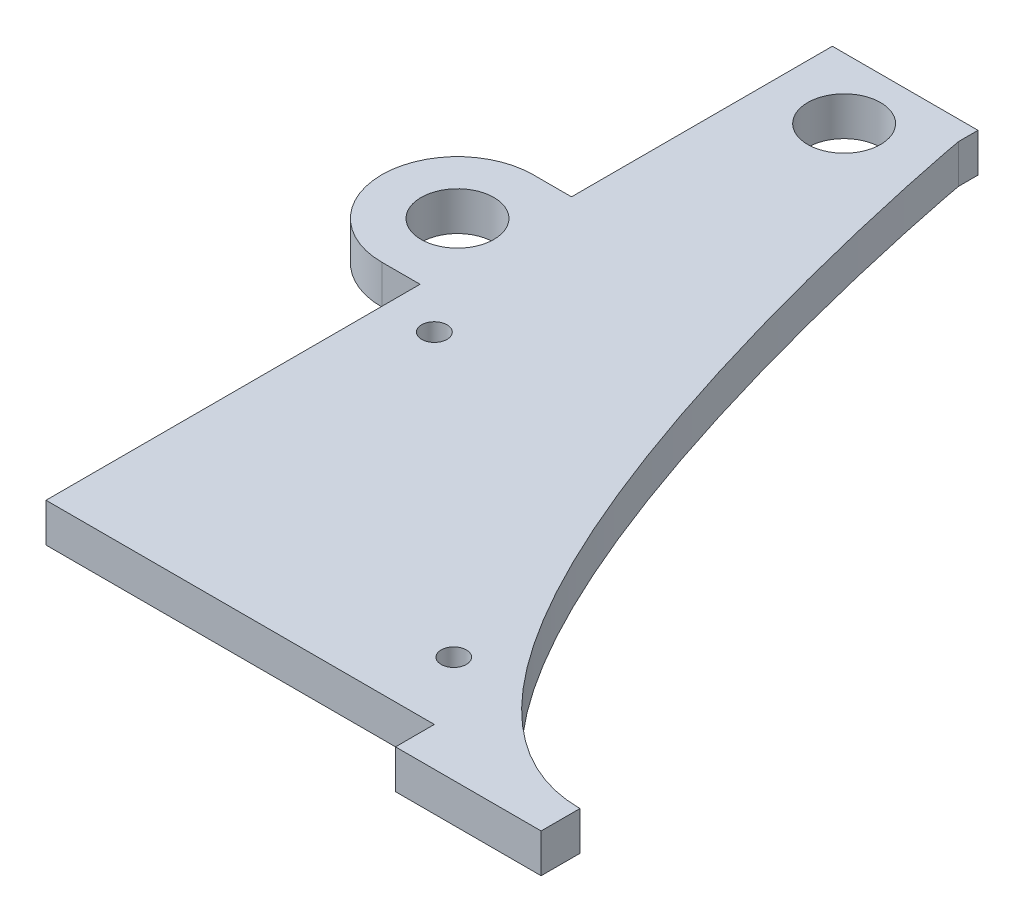
ISO-10303-21;
HEADER;
FILE_DESCRIPTION(('STEP AP214'),'2;1');
FILE_NAME('part.step','',(''),(''),'','','');
FILE_SCHEMA(('AUTOMOTIVE_DESIGN { 1 0 10303 214 1 1 1 1 }'));
ENDSEC;
DATA;
#1=APPLICATION_CONTEXT('core data for automotive mechanical design processes');
#2=APPLICATION_PROTOCOL_DEFINITION('international standard','automotive_design',2000,#1);
#3=PRODUCT_CONTEXT('',#1,'mechanical');
#4=PRODUCT('Part','Part','',(#3));
#5=PRODUCT_RELATED_PRODUCT_CATEGORY('part','',(#4));
#6=PRODUCT_DEFINITION_FORMATION('','',#4);
#7=PRODUCT_DEFINITION_CONTEXT('part definition',#1,'design');
#8=PRODUCT_DEFINITION('design','',#6,#7);
#9=PRODUCT_DEFINITION_SHAPE('','',#8);
#10=(LENGTH_UNIT() NAMED_UNIT(*) SI_UNIT(.MILLI.,.METRE.));
#11=(NAMED_UNIT(*) PLANE_ANGLE_UNIT() SI_UNIT($,.RADIAN.));
#12=(NAMED_UNIT(*) SI_UNIT($,.STERADIAN.) SOLID_ANGLE_UNIT());
#13=UNCERTAINTY_MEASURE_WITH_UNIT(LENGTH_MEASURE(1.E-05),#10,'distance_accuracy_value','');
#14=(GEOMETRIC_REPRESENTATION_CONTEXT(3) GLOBAL_UNCERTAINTY_ASSIGNED_CONTEXT((#13)) GLOBAL_UNIT_ASSIGNED_CONTEXT((#10,
#11,#12)) REPRESENTATION_CONTEXT('',''));
#15=CARTESIAN_POINT('',(0.,0.,0.));
#16=DIRECTION('',(0.,0.,1.));
#17=DIRECTION('',(1.,0.,0.));
#18=AXIS2_PLACEMENT_3D('',#15,#16,#17);
#19=CARTESIAN_POINT('',(-9.525,5.08,48.8950000000001));
#20=DIRECTION('',(1.,0.,0.));
#21=DIRECTION('',(0.,0.,-1.));
#22=AXIS2_PLACEMENT_3D('',#19,#20,#21);
#23=PLANE('',#22);
#24=DIRECTION('',(0.,0.,1.));
#25=VECTOR('',#24,1.);
#26=CARTESIAN_POINT('',(-9.525,5.08,48.8950000000001));
#27=LINE('',#26,#25);
#28=CARTESIAN_POINT('',(-9.52499999999999,5.08,-0.0375919999999405));
#29=VERTEX_POINT('',#28);
#30=CARTESIAN_POINT('',(-9.525,5.08,48.8950000000001));
#31=VERTEX_POINT('',#30);
#32=EDGE_CURVE('E58',#29,#31,#27,.T.);
#33=ORIENTED_EDGE('',*,*,#32,.F.);
#34=DIRECTION('',(0.,-1.,0.));
#35=VECTOR('',#34,1.);
#36=CARTESIAN_POINT('',(-9.52499999999998,5.08,-0.0375919999999405));
#37=LINE('',#36,#35);
#38=CARTESIAN_POINT('',(-9.52499999999999,0.,-0.0375919999999405));
#39=VERTEX_POINT('',#38);
#40=EDGE_CURVE('E179',#29,#39,#37,.T.);
#41=ORIENTED_EDGE('',*,*,#40,.T.);
#42=DIRECTION('',(0.,0.,1.));
#43=VECTOR('',#42,1.);
#44=CARTESIAN_POINT('',(-9.525,0.,48.8950000000001));
#45=LINE('',#44,#43);
#46=CARTESIAN_POINT('',(-9.525,0.,48.8950000000001));
#47=VERTEX_POINT('',#46);
#48=EDGE_CURVE('E494',#39,#47,#45,.T.);
#49=ORIENTED_EDGE('',*,*,#48,.T.);
#50=DIRECTION('',(0.,-1.,0.));
#51=VECTOR('',#50,1.);
#52=CARTESIAN_POINT('',(-9.525,5.08,48.8950000000001));
#53=LINE('',#52,#51);
#54=EDGE_CURVE('E521',#31,#47,#53,.T.);
#55=ORIENTED_EDGE('',*,*,#54,.F.);
#56=EDGE_LOOP('',(#33,#41,#49,#55));
#57=FACE_BOUND('',#56,.T.);
#58=ADVANCED_FACE('F42',(#57),#23,.F.);
#59=CARTESIAN_POINT('',(22.7352910938507,5.08,-1.18732961513015));
#60=DIRECTION('',(0.,-1.,0.));
#61=DIRECTION('',(0.,0.,-1.));
#62=AXIS2_PLACEMENT_3D('',#59,#60,#61);
#63=PLANE('',#62);
#64=DIRECTION('',(-1.,0.,0.));
#65=VECTOR('',#64,1.);
#66=CARTESIAN_POINT('',(-14.535912,5.08,-0.0375919999999405));
#67=LINE('',#66,#65);
#68=CARTESIAN_POINT('',(-14.535912,5.08,-0.0375919999999405));
#69=VERTEX_POINT('',#68);
#70=EDGE_CURVE('E144',#29,#69,#67,.T.);
#71=ORIENTED_EDGE('',*,*,#70,.F.);
#72=ORIENTED_EDGE('',*,*,#32,.T.);
#73=DIRECTION('',(1.,0.,0.));
#74=VECTOR('',#73,1.);
#75=CARTESIAN_POINT('',(60.325,5.08,48.8950000000001));
#76=LINE('',#75,#74);
#77=CARTESIAN_POINT('',(41.275,5.08,48.8950000000001));
#78=VERTEX_POINT('',#77);
#79=EDGE_CURVE('E251',#31,#78,#76,.T.);
#80=ORIENTED_EDGE('',*,*,#79,.T.);
#81=DIRECTION('',(0.,0.,1.));
#82=VECTOR('',#81,1.);
#83=CARTESIAN_POINT('',(41.275,5.08,48.8950000000001));
#84=LINE('',#83,#82);
#85=CARTESIAN_POINT('',(41.275,5.08,53.9750000000001));
#86=VERTEX_POINT('',#85);
#87=EDGE_CURVE('E205',#78,#86,#84,.T.);
#88=ORIENTED_EDGE('',*,*,#87,.T.);
#89=DIRECTION('',(1.,0.,0.));
#90=VECTOR('',#89,1.);
#91=CARTESIAN_POINT('',(60.325,5.08,53.9750000000001));
#92=LINE('',#91,#90);
#93=CARTESIAN_POINT('',(60.325,5.08,53.9750000000001));
#94=VERTEX_POINT('',#93);
#95=EDGE_CURVE('E200',#86,#94,#92,.T.);
#96=ORIENTED_EDGE('',*,*,#95,.T.);
#97=DIRECTION('',(0.,0.,-1.));
#98=VECTOR('',#97,1.);
#99=CARTESIAN_POINT('',(60.325,5.08,48.8950000000001));
#100=LINE('',#99,#98);
#101=CARTESIAN_POINT('',(60.325,5.08,48.8950000000001));
#102=VERTEX_POINT('',#101);
#103=EDGE_CURVE('E188',#94,#102,#100,.T.);
#104=ORIENTED_EDGE('',*,*,#103,.T.);
#105=CARTESIAN_POINT('',(60.325,5.08,48.895));
#106=CARTESIAN_POINT('',(27.8191095836019,5.08,48.895));
#107=CARTESIAN_POINT('',(9.525,5.08,-51.214545640347));
#108=CARTESIAN_POINT('',(9.525,5.08,-51.435));
#109=B_SPLINE_CURVE_WITH_KNOTS('',3,(#105,#106,#107,#108),.UNSPECIFIED.,.F.,.F.,(4,4),(0.,1.),.UNSPECIFIED.);
#110=CARTESIAN_POINT('',(9.525,5.08,-51.435));
#111=VERTEX_POINT('',#110);
#112=EDGE_CURVE('E255',#102,#111,#109,.T.);
#113=ORIENTED_EDGE('',*,*,#112,.T.);
#114=DIRECTION('',(0.,0.,-1.));
#115=VECTOR('',#114,1.);
#116=CARTESIAN_POINT('',(9.525,5.08,-51.435));
#117=LINE('',#116,#115);
#118=CARTESIAN_POINT('',(9.52499999999999,5.08,-53.9749999999999));
#119=VERTEX_POINT('',#118);
#120=EDGE_CURVE('E241',#111,#119,#117,.T.);
#121=ORIENTED_EDGE('',*,*,#120,.T.);
#122=DIRECTION('',(-1.,0.,0.));
#123=VECTOR('',#122,1.);
#124=CARTESIAN_POINT('',(-9.52499999999998,5.08,-53.9749999999999));
#125=LINE('',#124,#123);
#126=CARTESIAN_POINT('',(-9.52499999999998,5.08,-53.9749999999999));
#127=VERTEX_POINT('',#126);
#128=EDGE_CURVE('E245',#119,#127,#125,.T.);
#129=ORIENTED_EDGE('',*,*,#128,.T.);
#130=CARTESIAN_POINT('',(-9.52499999999999,5.08,-19.8495919999999));
#131=VERTEX_POINT('',#130);
#132=EDGE_CURVE('E153',#127,#131,#27,.T.);
#133=ORIENTED_EDGE('',*,*,#132,.T.);
#134=DIRECTION('',(1.,0.,0.));
#135=VECTOR('',#134,1.);
#136=CARTESIAN_POINT('',(-14.535912,5.08,-19.8495919999999));
#137=LINE('',#136,#135);
#138=CARTESIAN_POINT('',(-14.535912,5.08,-19.8495919999999));
#139=VERTEX_POINT('',#138);
#140=EDGE_CURVE('E136',#139,#131,#137,.T.);
#141=ORIENTED_EDGE('',*,*,#140,.F.);
#142=CARTESIAN_POINT('',(-14.535912,5.08,-9.94359199999994));
#143=DIRECTION('',(0.,-1.,0.));
#144=DIRECTION('',(0.,0.,-1.));
#145=AXIS2_PLACEMENT_3D('',#142,#143,#144);
#146=CIRCLE('',#145,9.906);
#147=EDGE_CURVE('E151',#69,#139,#146,.T.);
#148=ORIENTED_EDGE('',*,*,#147,.F.);
#149=EDGE_LOOP('',(#71,#72,#80,#88,#96,#104,#113,#121,#129,#133,#141,#148));
#150=FACE_BOUND('',#149,.T.);
#151=CARTESIAN_POINT('',(34.925,5.08,40.0050000000001));
#152=DIRECTION('',(0.,-1.,0.));
#153=DIRECTION('',(0.,0.,-1.));
#154=AXIS2_PLACEMENT_3D('',#151,#152,#153);
#155=CIRCLE('',#154,1.651);
#156=CARTESIAN_POINT('',(34.925,5.08,38.3540000000001));
#157=VERTEX_POINT('',#156);
#158=EDGE_CURVE('E184',#157,#157,#155,.T.);
#159=ORIENTED_EDGE('',*,*,#158,.T.);
#160=EDGE_LOOP('',(#159));
#161=FACE_BOUND('',#160,.T.);
#162=CARTESIAN_POINT('',(-3.17499999999998,5.08,4.44500000000005));
#163=DIRECTION('',(0.,-1.,0.));
#164=DIRECTION('',(0.,0.,-1.));
#165=AXIS2_PLACEMENT_3D('',#162,#163,#164);
#166=CIRCLE('',#165,1.66072838208594);
#167=CARTESIAN_POINT('',(-3.17499999999998,5.08,2.78427161791411));
#168=VERTEX_POINT('',#167);
#169=EDGE_CURVE('E178',#168,#168,#166,.T.);
#170=ORIENTED_EDGE('',*,*,#169,.T.);
#171=EDGE_LOOP('',(#170));
#172=FACE_BOUND('',#171,.T.);
#173=CARTESIAN_POINT('',(0.,5.08,-45.9866999999999));
#174=DIRECTION('',(0.,1.,0.));
#175=DIRECTION('',(0.,0.,1.));
#176=AXIS2_PLACEMENT_3D('',#173,#174,#175);
#177=CIRCLE('',#176,4.7625);
#178=CARTESIAN_POINT('',(0.,5.08,-41.2241999999999));
#179=VERTEX_POINT('',#178);
#180=EDGE_CURVE('E233',#179,#179,#177,.T.);
#181=ORIENTED_EDGE('',*,*,#180,.F.);
#182=EDGE_LOOP('',(#181));
#183=FACE_BOUND('',#182,.T.);
#184=CARTESIAN_POINT('',(-14.535912,5.08,-9.94359199999994));
#185=DIRECTION('',(0.,-1.,0.));
#186=DIRECTION('',(0.,0.,-1.));
#187=AXIS2_PLACEMENT_3D('',#184,#185,#186);
#188=CIRCLE('',#187,4.7625);
#189=CARTESIAN_POINT('',(-14.535912,5.08,-14.7060919999999));
#190=VERTEX_POINT('',#189);
#191=EDGE_CURVE('E173',#190,#190,#188,.T.);
#192=ORIENTED_EDGE('',*,*,#191,.T.);
#193=EDGE_LOOP('',(#192));
#194=FACE_BOUND('',#193,.T.);
#195=ADVANCED_FACE('F149',(#150,#161,#172,#183,#194),#63,.F.);
#196=CARTESIAN_POINT('',(22.7352910938507,0.,-1.18732961513015));
#197=DIRECTION('',(0.,-1.,0.));
#198=DIRECTION('',(0.,0.,-1.));
#199=AXIS2_PLACEMENT_3D('',#196,#197,#198);
#200=PLANE('',#199);
#201=ORIENTED_EDGE('',*,*,#48,.F.);
#202=DIRECTION('',(-1.,0.,0.));
#203=VECTOR('',#202,1.);
#204=CARTESIAN_POINT('',(-14.535912,0.,-0.0375919999999405));
#205=LINE('',#204,#203);
#206=CARTESIAN_POINT('',(-14.535912,0.,-0.0375919999999405));
#207=VERTEX_POINT('',#206);
#208=EDGE_CURVE('E159',#39,#207,#205,.T.);
#209=ORIENTED_EDGE('',*,*,#208,.T.);
#210=CARTESIAN_POINT('',(-14.535912,0.,-9.94359199999994));
#211=DIRECTION('',(0.,-1.,0.));
#212=DIRECTION('',(0.,0.,-1.));
#213=AXIS2_PLACEMENT_3D('',#210,#211,#212);
#214=CIRCLE('',#213,9.906);
#215=CARTESIAN_POINT('',(-14.535912,0.,-19.8495919999999));
#216=VERTEX_POINT('',#215);
#217=EDGE_CURVE('E170',#207,#216,#214,.T.);
#218=ORIENTED_EDGE('',*,*,#217,.T.);
#219=DIRECTION('',(1.,0.,0.));
#220=VECTOR('',#219,1.);
#221=CARTESIAN_POINT('',(-14.535912,0.,-19.8495919999999));
#222=LINE('',#221,#220);
#223=CARTESIAN_POINT('',(-9.52499999999999,0.,-19.8495919999999));
#224=VERTEX_POINT('',#223);
#225=EDGE_CURVE('E138',#216,#224,#222,.T.);
#226=ORIENTED_EDGE('',*,*,#225,.T.);
#227=CARTESIAN_POINT('',(-9.52499999999998,0.,-53.9749999999999));
#228=VERTEX_POINT('',#227);
#229=EDGE_CURVE('E499',#228,#224,#45,.T.);
#230=ORIENTED_EDGE('',*,*,#229,.F.);
#231=DIRECTION('',(-1.,0.,0.));
#232=VECTOR('',#231,1.);
#233=CARTESIAN_POINT('',(-9.52499999999998,0.,-53.9749999999999));
#234=LINE('',#233,#232);
#235=CARTESIAN_POINT('',(9.52499999999999,0.,-53.9749999999999));
#236=VERTEX_POINT('',#235);
#237=EDGE_CURVE('E500',#236,#228,#234,.T.);
#238=ORIENTED_EDGE('',*,*,#237,.F.);
#239=DIRECTION('',(0.,0.,-1.));
#240=VECTOR('',#239,1.);
#241=CARTESIAN_POINT('',(9.525,0.,-51.435));
#242=LINE('',#241,#240);
#243=CARTESIAN_POINT('',(9.525,0.,-51.435));
#244=VERTEX_POINT('',#243);
#245=EDGE_CURVE('E237',#244,#236,#242,.T.);
#246=ORIENTED_EDGE('',*,*,#245,.F.);
#247=CARTESIAN_POINT('',(60.325,0.,48.895));
#248=CARTESIAN_POINT('',(27.8191095836019,0.,48.895));
#249=CARTESIAN_POINT('',(9.525,0.,-51.214545640347));
#250=CARTESIAN_POINT('',(9.525,0.,-51.435));
#251=B_SPLINE_CURVE_WITH_KNOTS('',3,(#247,#248,#249,#250),.UNSPECIFIED.,.F.,.F.,(4,4),(0.,1.),.UNSPECIFIED.);
#252=CARTESIAN_POINT('',(60.325,0.,48.8950000000001));
#253=VERTEX_POINT('',#252);
#254=EDGE_CURVE('E246',#253,#244,#251,.T.);
#255=ORIENTED_EDGE('',*,*,#254,.F.);
#256=DIRECTION('',(0.,0.,-1.));
#257=VECTOR('',#256,1.);
#258=CARTESIAN_POINT('',(60.325,0.,48.8950000000001));
#259=LINE('',#258,#257);
#260=CARTESIAN_POINT('',(60.325,0.,53.9750000000001));
#261=VERTEX_POINT('',#260);
#262=EDGE_CURVE('E212',#261,#253,#259,.T.);
#263=ORIENTED_EDGE('',*,*,#262,.F.);
#264=DIRECTION('',(1.,0.,0.));
#265=VECTOR('',#264,1.);
#266=CARTESIAN_POINT('',(60.325,0.,53.9750000000001));
#267=LINE('',#266,#265);
#268=CARTESIAN_POINT('',(41.275,0.,53.9750000000001));
#269=VERTEX_POINT('',#268);
#270=EDGE_CURVE('E217',#269,#261,#267,.T.);
#271=ORIENTED_EDGE('',*,*,#270,.F.);
#272=DIRECTION('',(0.,0.,1.));
#273=VECTOR('',#272,1.);
#274=CARTESIAN_POINT('',(41.275,0.,48.8950000000001));
#275=LINE('',#274,#273);
#276=CARTESIAN_POINT('',(41.275,0.,48.8950000000001));
#277=VERTEX_POINT('',#276);
#278=EDGE_CURVE('E222',#277,#269,#275,.T.);
#279=ORIENTED_EDGE('',*,*,#278,.F.);
#280=DIRECTION('',(1.,0.,0.));
#281=VECTOR('',#280,1.);
#282=CARTESIAN_POINT('',(60.325,0.,48.8950000000001));
#283=LINE('',#282,#281);
#284=EDGE_CURVE('E496',#47,#277,#283,.T.);
#285=ORIENTED_EDGE('',*,*,#284,.F.);
#286=EDGE_LOOP('',(#201,#209,#218,#226,#230,#238,#246,#255,#263,#271,#279,#285));
#287=FACE_BOUND('',#286,.T.);
#288=CARTESIAN_POINT('',(34.925,0.,40.0050000000001));
#289=DIRECTION('',(0.,-1.,0.));
#290=DIRECTION('',(0.,0.,-1.));
#291=AXIS2_PLACEMENT_3D('',#288,#289,#290);
#292=CIRCLE('',#291,1.651);
#293=CARTESIAN_POINT('',(34.925,0.,38.3540000000001));
#294=VERTEX_POINT('',#293);
#295=EDGE_CURVE('E189',#294,#294,#292,.T.);
#296=ORIENTED_EDGE('',*,*,#295,.F.);
#297=EDGE_LOOP('',(#296));
#298=FACE_BOUND('',#297,.T.);
#299=CARTESIAN_POINT('',(-3.17499999999998,0.,4.44500000000005));
#300=DIRECTION('',(0.,-1.,0.));
#301=DIRECTION('',(0.,0.,-1.));
#302=AXIS2_PLACEMENT_3D('',#299,#300,#301);
#303=CIRCLE('',#302,1.66072838208594);
#304=CARTESIAN_POINT('',(-3.17499999999998,0.,2.78427161791411));
#305=VERTEX_POINT('',#304);
#306=EDGE_CURVE('E193',#305,#305,#303,.T.);
#307=ORIENTED_EDGE('',*,*,#306,.F.);
#308=EDGE_LOOP('',(#307));
#309=FACE_BOUND('',#308,.T.);
#310=CARTESIAN_POINT('',(0.,0.,-45.9866999999999));
#311=DIRECTION('',(0.,1.,0.));
#312=DIRECTION('',(0.,0.,1.));
#313=AXIS2_PLACEMENT_3D('',#310,#311,#312);
#314=CIRCLE('',#313,4.7625);
#315=CARTESIAN_POINT('',(0.,0.,-41.2241999999999));
#316=VERTEX_POINT('',#315);
#317=EDGE_CURVE('E215',#316,#316,#314,.T.);
#318=ORIENTED_EDGE('',*,*,#317,.T.);
#319=EDGE_LOOP('',(#318));
#320=FACE_BOUND('',#319,.T.);
#321=CARTESIAN_POINT('',(-14.535912,0.,-9.94359199999994));
#322=DIRECTION('',(0.,-1.,0.));
#323=DIRECTION('',(0.,0.,-1.));
#324=AXIS2_PLACEMENT_3D('',#321,#322,#323);
#325=CIRCLE('',#324,4.7625);
#326=CARTESIAN_POINT('',(-14.535912,0.,-14.7060919999999));
#327=VERTEX_POINT('',#326);
#328=EDGE_CURVE('E165',#327,#327,#325,.T.);
#329=ORIENTED_EDGE('',*,*,#328,.F.);
#330=EDGE_LOOP('',(#329));
#331=FACE_BOUND('',#330,.T.);
#332=ADVANCED_FACE('F274',(#287,#298,#309,#320,#331),#200,.T.);
#333=CARTESIAN_POINT('',(9.525,5.08,-51.435));
#334=DIRECTION('',(-1.,0.,0.));
#335=DIRECTION('',(0.,0.,1.));
#336=AXIS2_PLACEMENT_3D('',#333,#334,#335);
#337=PLANE('',#336);
#338=ORIENTED_EDGE('',*,*,#245,.T.);
#339=DIRECTION('',(0.,-1.,0.));
#340=VECTOR('',#339,1.);
#341=CARTESIAN_POINT('',(9.52499999999999,5.08,-53.9749999999999));
#342=LINE('',#341,#340);
#343=EDGE_CURVE('E11',#119,#236,#342,.T.);
#344=ORIENTED_EDGE('',*,*,#343,.F.);
#345=ORIENTED_EDGE('',*,*,#120,.F.);
#346=DIRECTION('',(0.,-1.,0.));
#347=VECTOR('',#346,1.);
#348=CARTESIAN_POINT('',(9.525,5.08,-51.435));
#349=LINE('',#348,#347);
#350=EDGE_CURVE('E261',#111,#244,#349,.T.);
#351=ORIENTED_EDGE('',*,*,#350,.T.);
#352=EDGE_LOOP('',(#338,#344,#345,#351));
#353=FACE_BOUND('',#352,.T.);
#354=ADVANCED_FACE('F44',(#353),#337,.F.);
#355=CARTESIAN_POINT('',(-9.52499999999998,5.08,-53.9749999999999));
#356=DIRECTION('',(0.,0.,1.));
#357=DIRECTION('',(1.,0.,0.));
#358=AXIS2_PLACEMENT_3D('',#355,#356,#357);
#359=PLANE('',#358);
#360=ORIENTED_EDGE('',*,*,#237,.T.);
#361=DIRECTION('',(0.,-1.,0.));
#362=VECTOR('',#361,1.);
#363=CARTESIAN_POINT('',(-9.52499999999998,5.08,-53.9749999999999));
#364=LINE('',#363,#362);
#365=EDGE_CURVE('E51',#127,#228,#364,.T.);
#366=ORIENTED_EDGE('',*,*,#365,.F.);
#367=ORIENTED_EDGE('',*,*,#128,.F.);
#368=ORIENTED_EDGE('',*,*,#343,.T.);
#369=EDGE_LOOP('',(#360,#366,#367,#368));
#370=FACE_BOUND('',#369,.T.);
#371=ADVANCED_FACE('F281',(#370),#359,.F.);
#372=ORIENTED_EDGE('',*,*,#229,.T.);
#373=DIRECTION('',(0.,-1.,0.));
#374=VECTOR('',#373,1.);
#375=CARTESIAN_POINT('',(-9.52499999999998,5.08,-19.8495919999999));
#376=LINE('',#375,#374);
#377=EDGE_CURVE('E66',#131,#224,#376,.T.);
#378=ORIENTED_EDGE('',*,*,#377,.F.);
#379=ORIENTED_EDGE('',*,*,#132,.F.);
#380=ORIENTED_EDGE('',*,*,#365,.T.);
#381=EDGE_LOOP('',(#372,#378,#379,#380));
#382=FACE_BOUND('',#381,.T.);
#383=ADVANCED_FACE('F278',(#382),#23,.F.);
#384=CARTESIAN_POINT('',(60.325,5.08,48.8950000000001));
#385=DIRECTION('',(0.,0.,-1.));
#386=DIRECTION('',(-1.,0.,0.));
#387=AXIS2_PLACEMENT_3D('',#384,#385,#386);
#388=PLANE('',#387);
#389=ORIENTED_EDGE('',*,*,#284,.T.);
#390=DIRECTION('',(0.,1.,0.));
#391=VECTOR('',#390,1.);
#392=CARTESIAN_POINT('',(41.275,-19.7157018642502,48.8950000000001));
#393=LINE('',#392,#391);
#394=EDGE_CURVE('E204',#277,#78,#393,.T.);
#395=ORIENTED_EDGE('',*,*,#394,.T.);
#396=ORIENTED_EDGE('',*,*,#79,.F.);
#397=ORIENTED_EDGE('',*,*,#54,.T.);
#398=EDGE_LOOP('',(#389,#395,#396,#397));
#399=FACE_BOUND('',#398,.T.);
#400=ADVANCED_FACE('F272',(#399),#388,.F.);
#401=DIRECTION('',(0.,-1.,0.));
#402=VECTOR('',#401,1.);
#403=SURFACE_OF_LINEAR_EXTRUSION('',#109,#402);
#404=ORIENTED_EDGE('',*,*,#254,.T.);
#405=ORIENTED_EDGE('',*,*,#350,.F.);
#406=ORIENTED_EDGE('',*,*,#112,.F.);
#407=DIRECTION('',(0.,-1.,0.));
#408=VECTOR('',#407,1.);
#409=CARTESIAN_POINT('',(60.325,5.08,48.8950000000001));
#410=LINE('',#409,#408);
#411=EDGE_CURVE('E517',#102,#253,#410,.T.);
#412=ORIENTED_EDGE('',*,*,#411,.T.);
#413=EDGE_LOOP('',(#404,#405,#406,#412));
#414=FACE_BOUND('',#413,.T.);
#415=ADVANCED_FACE('F267',(#414),#403,.F.);
#416=CARTESIAN_POINT('',(0.,5.08,-45.9866999999999));
#417=DIRECTION('',(0.,-1.,0.));
#418=DIRECTION('',(0.,0.,-1.));
#419=AXIS2_PLACEMENT_3D('',#416,#417,#418);
#420=CYLINDRICAL_SURFACE('',#419,4.7625);
#421=ORIENTED_EDGE('',*,*,#180,.T.);
#422=EDGE_LOOP('',(#421));
#423=FACE_BOUND('',#422,.T.);
#424=ORIENTED_EDGE('',*,*,#317,.F.);
#425=EDGE_LOOP('',(#424));
#426=FACE_BOUND('',#425,.T.);
#427=ADVANCED_FACE('F271',(#423,#426),#420,.F.);
#428=CARTESIAN_POINT('',(41.275,-19.7157018642502,48.8950000000001));
#429=DIRECTION('',(-1.,0.,0.));
#430=DIRECTION('',(0.,0.,1.));
#431=AXIS2_PLACEMENT_3D('',#428,#429,#430);
#432=PLANE('',#431);
#433=ORIENTED_EDGE('',*,*,#394,.F.);
#434=ORIENTED_EDGE('',*,*,#278,.T.);
#435=DIRECTION('',(0.,1.,0.));
#436=VECTOR('',#435,1.);
#437=CARTESIAN_POINT('',(41.275,-19.7157018642502,53.9750000000001));
#438=LINE('',#437,#436);
#439=EDGE_CURVE('E221',#269,#86,#438,.T.);
#440=ORIENTED_EDGE('',*,*,#439,.T.);
#441=ORIENTED_EDGE('',*,*,#87,.F.);
#442=EDGE_LOOP('',(#433,#434,#440,#441));
#443=FACE_BOUND('',#442,.T.);
#444=ADVANCED_FACE('F301',(#443),#432,.T.);
#445=CARTESIAN_POINT('',(60.325,-19.7157018642502,53.9750000000001));
#446=DIRECTION('',(0.,0.,1.));
#447=DIRECTION('',(1.,0.,0.));
#448=AXIS2_PLACEMENT_3D('',#445,#446,#447);
#449=PLANE('',#448);
#450=ORIENTED_EDGE('',*,*,#439,.F.);
#451=ORIENTED_EDGE('',*,*,#270,.T.);
#452=DIRECTION('',(0.,1.,0.));
#453=VECTOR('',#452,1.);
#454=CARTESIAN_POINT('',(60.325,-19.7157018642502,53.9750000000001));
#455=LINE('',#454,#453);
#456=EDGE_CURVE('E216',#261,#94,#455,.T.);
#457=ORIENTED_EDGE('',*,*,#456,.T.);
#458=ORIENTED_EDGE('',*,*,#95,.F.);
#459=EDGE_LOOP('',(#450,#451,#457,#458));
#460=FACE_BOUND('',#459,.T.);
#461=ADVANCED_FACE('F305',(#460),#449,.T.);
#462=CARTESIAN_POINT('',(60.325,-19.7157018642502,48.8950000000001));
#463=DIRECTION('',(1.,0.,0.));
#464=DIRECTION('',(0.,0.,-1.));
#465=AXIS2_PLACEMENT_3D('',#462,#463,#464);
#466=PLANE('',#465);
#467=ORIENTED_EDGE('',*,*,#456,.F.);
#468=ORIENTED_EDGE('',*,*,#262,.T.);
#469=ORIENTED_EDGE('',*,*,#411,.F.);
#470=ORIENTED_EDGE('',*,*,#103,.F.);
#471=EDGE_LOOP('',(#467,#468,#469,#470));
#472=FACE_BOUND('',#471,.T.);
#473=ADVANCED_FACE('F309',(#472),#466,.T.);
#474=CARTESIAN_POINT('',(-3.17499999999998,5.08,4.44500000000005));
#475=DIRECTION('',(0.,-1.,0.));
#476=DIRECTION('',(0.,0.,-1.));
#477=AXIS2_PLACEMENT_3D('',#474,#475,#476);
#478=CYLINDRICAL_SURFACE('',#477,1.66072838208594);
#479=ORIENTED_EDGE('',*,*,#169,.F.);
#480=EDGE_LOOP('',(#479));
#481=FACE_BOUND('',#480,.T.);
#482=ORIENTED_EDGE('',*,*,#306,.T.);
#483=EDGE_LOOP('',(#482));
#484=FACE_BOUND('',#483,.T.);
#485=ADVANCED_FACE('F313',(#481,#484),#478,.F.);
#486=CARTESIAN_POINT('',(34.925,5.08,40.0050000000001));
#487=DIRECTION('',(0.,-1.,0.));
#488=DIRECTION('',(0.,0.,-1.));
#489=AXIS2_PLACEMENT_3D('',#486,#487,#488);
#490=CYLINDRICAL_SURFACE('',#489,1.651);
#491=ORIENTED_EDGE('',*,*,#158,.F.);
#492=EDGE_LOOP('',(#491));
#493=FACE_BOUND('',#492,.T.);
#494=ORIENTED_EDGE('',*,*,#295,.T.);
#495=EDGE_LOOP('',(#494));
#496=FACE_BOUND('',#495,.T.);
#497=ADVANCED_FACE('F317',(#493,#496),#490,.F.);
#498=CARTESIAN_POINT('',(-14.535912,5.08,-9.94359199999994));
#499=DIRECTION('',(0.,-1.,0.));
#500=DIRECTION('',(0.,0.,-1.));
#501=AXIS2_PLACEMENT_3D('',#498,#499,#500);
#502=CYLINDRICAL_SURFACE('',#501,9.906);
#503=ORIENTED_EDGE('',*,*,#217,.F.);
#504=DIRECTION('',(0.,-1.,0.));
#505=VECTOR('',#504,1.);
#506=CARTESIAN_POINT('',(-14.535912,5.08,-0.0375919999999405));
#507=LINE('',#506,#505);
#508=EDGE_CURVE('E157',#69,#207,#507,.T.);
#509=ORIENTED_EDGE('',*,*,#508,.F.);
#510=ORIENTED_EDGE('',*,*,#147,.T.);
#511=DIRECTION('',(0.,-1.,0.));
#512=VECTOR('',#511,1.);
#513=CARTESIAN_POINT('',(-14.535912,5.08,-19.8495919999999));
#514=LINE('',#513,#512);
#515=EDGE_CURVE('E133',#139,#216,#514,.T.);
#516=ORIENTED_EDGE('',*,*,#515,.T.);
#517=EDGE_LOOP('',(#503,#509,#510,#516));
#518=FACE_BOUND('',#517,.T.);
#519=ADVANCED_FACE('F156',(#518),#502,.T.);
#520=CARTESIAN_POINT('',(-14.535912,5.08,-0.0375919999999405));
#521=DIRECTION('',(0.,0.,1.));
#522=DIRECTION('',(1.,0.,0.));
#523=AXIS2_PLACEMENT_3D('',#520,#521,#522);
#524=PLANE('',#523);
#525=ORIENTED_EDGE('',*,*,#208,.F.);
#526=ORIENTED_EDGE('',*,*,#40,.F.);
#527=ORIENTED_EDGE('',*,*,#70,.T.);
#528=ORIENTED_EDGE('',*,*,#508,.T.);
#529=EDGE_LOOP('',(#525,#526,#527,#528));
#530=FACE_BOUND('',#529,.T.);
#531=ADVANCED_FACE('F324',(#530),#524,.T.);
#532=CARTESIAN_POINT('',(-14.535912,5.08,-19.8495919999999));
#533=DIRECTION('',(0.,0.,-1.));
#534=DIRECTION('',(-1.,0.,0.));
#535=AXIS2_PLACEMENT_3D('',#532,#533,#534);
#536=PLANE('',#535);
#537=ORIENTED_EDGE('',*,*,#225,.F.);
#538=ORIENTED_EDGE('',*,*,#515,.F.);
#539=ORIENTED_EDGE('',*,*,#140,.T.);
#540=ORIENTED_EDGE('',*,*,#377,.T.);
#541=EDGE_LOOP('',(#537,#538,#539,#540));
#542=FACE_BOUND('',#541,.T.);
#543=ADVANCED_FACE('F135',(#542),#536,.T.);
#544=CARTESIAN_POINT('',(-14.535912,5.08,-9.94359199999994));
#545=DIRECTION('',(0.,-1.,0.));
#546=DIRECTION('',(0.,0.,-1.));
#547=AXIS2_PLACEMENT_3D('',#544,#545,#546);
#548=CYLINDRICAL_SURFACE('',#547,4.7625);
#549=ORIENTED_EDGE('',*,*,#191,.F.);
#550=EDGE_LOOP('',(#549));
#551=FACE_BOUND('',#550,.T.);
#552=ORIENTED_EDGE('',*,*,#328,.T.);
#553=EDGE_LOOP('',(#552));
#554=FACE_BOUND('',#553,.T.);
#555=ADVANCED_FACE('F327',(#551,#554),#548,.F.);
#556=CLOSED_SHELL('',(#58,#195,#332,#354,#371,#383,#400,#415,#427,#444,#461,#473,#485,#497,#519,
#531,#543,#555));
#557=MANIFOLD_SOLID_BREP('B2',#556);
#558=ADVANCED_BREP_SHAPE_REPRESENTATION('',(#18,#557),#14);
#559=SHAPE_DEFINITION_REPRESENTATION(#9,#558);
ENDSEC;
END-ISO-10303-21;
